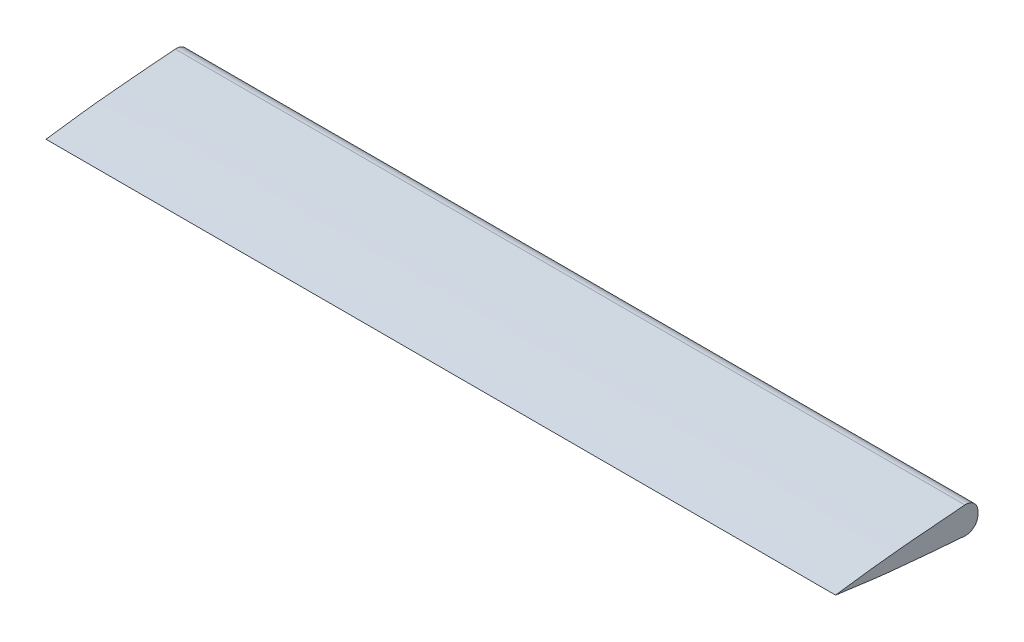
ISO-10303-21;
HEADER;
FILE_DESCRIPTION(('STEP AP214'),'2;1');
FILE_NAME('part.step','',(''),(''),'','','');
FILE_SCHEMA(('AUTOMOTIVE_DESIGN { 1 0 10303 214 1 1 1 1 }'));
ENDSEC;
DATA;
#1=APPLICATION_CONTEXT('core data for automotive mechanical design processes');
#2=APPLICATION_PROTOCOL_DEFINITION('international standard','automotive_design',2000,#1);
#3=PRODUCT_CONTEXT('',#1,'mechanical');
#4=PRODUCT('Part','Part','',(#3));
#5=PRODUCT_RELATED_PRODUCT_CATEGORY('part','',(#4));
#6=PRODUCT_DEFINITION_FORMATION('','',#4);
#7=PRODUCT_DEFINITION_CONTEXT('part definition',#1,'design');
#8=PRODUCT_DEFINITION('design','',#6,#7);
#9=PRODUCT_DEFINITION_SHAPE('','',#8);
#10=(LENGTH_UNIT() NAMED_UNIT(*) SI_UNIT(.MILLI.,.METRE.));
#11=(NAMED_UNIT(*) PLANE_ANGLE_UNIT() SI_UNIT($,.RADIAN.));
#12=(NAMED_UNIT(*) SI_UNIT($,.STERADIAN.) SOLID_ANGLE_UNIT());
#13=UNCERTAINTY_MEASURE_WITH_UNIT(LENGTH_MEASURE(1.E-05),#10,'distance_accuracy_value','');
#14=(GEOMETRIC_REPRESENTATION_CONTEXT(3) GLOBAL_UNCERTAINTY_ASSIGNED_CONTEXT((#13)) GLOBAL_UNIT_ASSIGNED_CONTEXT((#10,
#11,#12)) REPRESENTATION_CONTEXT('',''));
#15=CARTESIAN_POINT('',(0.,0.,0.));
#16=DIRECTION('',(0.,0.,1.));
#17=DIRECTION('',(1.,0.,0.));
#18=AXIS2_PLACEMENT_3D('',#15,#16,#17);
#19=CARTESIAN_POINT('',(95.,-1.92918916965094,35.0000000000882));
#20=CARTESIAN_POINT('',(95.,-2.17557439307267,33.160206008529));
#21=CARTESIAN_POINT('',(95.,-2.66632647643486,29.4805088024827));
#22=CARTESIAN_POINT('',(95.,-3.41585990116421,23.9619552997979));
#23=CARTESIAN_POINT('',(95.,-3.95970264975798,18.4191434620528));
#24=CARTESIAN_POINT('',(95.,-4.4647734457858,12.8737838001964));
#25=CARTESIAN_POINT('',(95.,-4.84793778183102,8.24885263101138));
#26=CARTESIAN_POINT('',(95.,-5.13594709462944,4.54766157493358));
#27=CARTESIAN_POINT('',(95.,-5.3172452247453,2.1063633274242));
#28=CARTESIAN_POINT('',(95.,-5.42564338367872,0.590331068243133));
#29=CARTESIAN_POINT('',(95.,-5.46717732764397,1.00253139123652E-10));
#30=B_SPLINE_CURVE_WITH_KNOTS('',3,(#19,#20,#21,#22,#23,#24,#25,#26,#27,#28,#29),.UNSPECIFIED.,
.F.,.F.,(4,1,1,1,1,1,1,1,4),(0.811923721341245,0.841688208261256,0.871452695181268,
0.901217182101278,0.93098166902129,0.9607461559413,0.975628399401306,0.990510642861312,1.),.UNSPECIFIED.);
#31=DIRECTION('',(-1.,0.,0.));
#32=VECTOR('',#31,1.);
#33=SURFACE_OF_LINEAR_EXTRUSION('',#30,#32);
#34=CARTESIAN_POINT('',(75.,-1.92918916965094,35.0000000000882));
#35=CARTESIAN_POINT('',(75.,-2.17557439307267,33.160206008529));
#36=CARTESIAN_POINT('',(75.,-2.66632647643486,29.4805088024827));
#37=CARTESIAN_POINT('',(75.,-3.41585990116421,23.9619552997979));
#38=CARTESIAN_POINT('',(75.,-3.95970264975798,18.4191434620528));
#39=CARTESIAN_POINT('',(75.,-4.4647734457858,12.8737838001964));
#40=CARTESIAN_POINT('',(75.,-4.84793778183102,8.24885263101138));
#41=CARTESIAN_POINT('',(75.,-5.13594709462944,4.54766157493358));
#42=CARTESIAN_POINT('',(75.,-5.3172452247453,2.1063633274242));
#43=CARTESIAN_POINT('',(75.,-5.42564338367872,0.590331068243133));
#44=CARTESIAN_POINT('',(75.,-5.46717732764397,1.00253139123652E-10));
#45=B_SPLINE_CURVE_WITH_KNOTS('',3,(#34,#35,#36,#37,#38,#39,#40,#41,#42,#43,#44),.UNSPECIFIED.,
.F.,.F.,(4,1,1,1,1,1,1,1,4),(0.811923721341245,0.841688208261256,0.871452695181268,
0.901217182101278,0.93098166902129,0.9607461559413,0.975628399401306,0.990510642861312,1.),.UNSPECIFIED.);
#46=CARTESIAN_POINT('',(75.,-5.23395472823332,3.22247788486881));
#47=VERTEX_POINT('',#46);
#48=CARTESIAN_POINT('',(75.,-4.53258784285491,12.));
#49=VERTEX_POINT('',#48);
#50=EDGE_CURVE('E272',#47,#49,#45,.F.);
#51=ORIENTED_EDGE('',*,*,#50,.F.);
#52=DIRECTION('',(-1.,0.,0.));
#53=VECTOR('',#52,1.);
#54=CARTESIAN_POINT('',(95.,-5.23395472823332,3.22247788486881));
#55=LINE('',#54,#53);
#56=CARTESIAN_POINT('',(97.,-5.23395472823345,3.22247788486705));
#57=VERTEX_POINT('',#56);
#58=EDGE_CURVE('E351',#57,#47,#55,.T.);
#59=ORIENTED_EDGE('',*,*,#58,.F.);
#60=CARTESIAN_POINT('',(97.,-1.92918916965094,35.0000000000882));
#61=CARTESIAN_POINT('',(97.,-1.97784978920074,34.6366433608864));
#62=CARTESIAN_POINT('',(97.,-2.02647161022136,34.273281531584));
#63=CARTESIAN_POINT('',(97.,-2.12368704921667,33.546552866673));
#64=CARTESIAN_POINT('',(97.,-2.17228066709682,33.1831860310516));
#65=CARTESIAN_POINT('',(97.,-2.26948887733085,32.4564543480221));
#66=CARTESIAN_POINT('',(97.,-2.31810346973077,32.0930895006201));
#67=CARTESIAN_POINT('',(97.,-2.41540465670598,31.3663690370475));
#68=CARTESIAN_POINT('',(97.,-2.4640912513607,31.0030134208875));
#69=CARTESIAN_POINT('',(97.,-2.56157560888904,30.2763508963883));
#70=CARTESIAN_POINT('',(97.,-2.61037336119507,29.9130439866326));
#71=CARTESIAN_POINT('',(97.,-2.70815582961272,29.1864554795267));
#72=CARTESIAN_POINT('',(97.,-2.75714054565528,28.8231738821672));
#73=CARTESIAN_POINT('',(97.,-2.85476309263819,28.0965646669991));
#74=CARTESIAN_POINT('',(97.,-2.90340092424832,27.7332370492807));
#75=CARTESIAN_POINT('',(97.,-2.99976120769806,27.0064595602992));
#76=CARTESIAN_POINT('',(97.,-3.04748365885674,26.6430096889454));
#77=CARTESIAN_POINT('',(97.,-3.12580258604219,26.0370215022744));
#78=CARTESIAN_POINT('',(97.,-3.1568084296504,25.7945361768171));
#79=CARTESIAN_POINT('',(97.,-3.21799548575084,25.3094614244014));
#80=CARTESIAN_POINT('',(97.,-3.24817669855135,25.0668719974821));
#81=CARTESIAN_POINT('',(97.,-3.30755373753616,24.5815748631894));
#82=CARTESIAN_POINT('',(97.,-3.33674957404386,24.3388671570822));
#83=CARTESIAN_POINT('',(97.,-3.3939641059896,23.8533130477647));
#84=CARTESIAN_POINT('',(97.,-3.42198280196338,23.6104666446175));
#85=CARTESIAN_POINT('',(97.,-3.47692412565455,23.1246515568309));
#86=CARTESIAN_POINT('',(97.,-3.50384675984782,22.8816828729224));
#87=CARTESIAN_POINT('',(97.,-3.55673460009936,22.3956412774917));
#88=CARTESIAN_POINT('',(97.,-3.58269980516509,22.1525683658617));
#89=CARTESIAN_POINT('',(97.,-3.65934733869446,21.4232082406151));
#90=CARTESIAN_POINT('',(97.,-3.70878045188032,20.9367897563355));
#91=CARTESIAN_POINT('',(97.,-3.80533182082476,19.9637159425367));
#92=CARTESIAN_POINT('',(97.,-3.85245003218248,19.4770606086554));
#93=CARTESIAN_POINT('',(97.,-3.92216728077433,18.7469838606732));
#94=CARTESIAN_POINT('',(97.,-3.94524647381487,18.5036080105316));
#95=CARTESIAN_POINT('',(97.,-3.99118971519483,18.0168360210816));
#96=CARTESIAN_POINT('',(97.,-4.01405376355185,17.773439881775));
#97=CARTESIAN_POINT('',(97.,-4.1110323123454,16.7357832870622));
#98=CARTESIAN_POINT('',(97.,-4.18403320669951,15.9414183645363));
#99=CARTESIAN_POINT('',(97.,-4.32741147591866,14.3524639158053));
#100=CARTESIAN_POINT('',(97.,-4.3977888906516,13.5578743931986));
#101=CARTESIAN_POINT('',(97.,-4.53575580560456,11.9684586916675));
#102=CARTESIAN_POINT('',(97.,-4.60334532454955,11.1736325143688));
#103=CARTESIAN_POINT('',(97.,-4.73595068599845,9.58386408911397));
#104=CARTESIAN_POINT('',(97.,-4.80096684329836,8.78892186736883));
#105=CARTESIAN_POINT('',(97.,-4.92868980525073,7.1988432813935));
#106=CARTESIAN_POINT('',(97.,-4.99139658477352,6.40370691514542));
#107=CARTESIAN_POINT('',(97.,-5.11445447595214,4.81323619262917));
#108=CARTESIAN_POINT('',(97.,-5.17480554120495,4.01790183277115));
#109=CARTESIAN_POINT('',(97.,-5.23395472823345,3.22247788486705));
#110=B_SPLINE_CURVE_WITH_KNOTS('',3,(#60,#61,#62,#63,#64,#65,#66,#67,#68,#69,#70,#71,#72,#73,
#74,#75,#76,#77,#78,#79,#80,#81,#82,#83,#84,#85,#86,#87,#88,#89,#90,#91,#92,#93,#94,#95,#96,#97,
#98,#99,#100,#101,#102,#103,#104,#105,#106,#107,#108,#109),.UNSPECIFIED.,.F.,.F.,(4,2,2,2,2,2,2,
2,2,2,2,2,2,2,2,2,2,2,2,2,2,2,2,2,4),(0.,1.09980139469961,2.19960645543168,3.29941394316692,
4.39922264509033,5.49893082378594,6.59863859639634,7.698344245053,8.79805071172301,
9.53142838044405,10.2648057750098,10.998175483896,11.7315448590075,12.4649099005178,
13.1982757022749,14.6650378540183,16.1318281279384,16.8652311563979,17.5986341248993,
19.991766251133,22.3848619951152,24.7779416631786,27.1707276783879,29.563539723203,
31.9563988780375),.UNSPECIFIED.);
#111=CARTESIAN_POINT('',(97.,-1.92918916965094,35.0000000000882));
#112=VERTEX_POINT('',#111);
#113=EDGE_CURVE('E170',#112,#57,#110,.T.);
#114=ORIENTED_EDGE('',*,*,#113,.F.);
#115=DIRECTION('',(-1.,0.,0.));
#116=VECTOR('',#115,1.);
#117=CARTESIAN_POINT('',(95.,-1.92918916965094,35.0000000000882));
#118=LINE('',#117,#116);
#119=CARTESIAN_POINT('',(-97.,-1.92918916965094,35.0000000000882));
#120=VERTEX_POINT('',#119);
#121=EDGE_CURVE('E354',#112,#120,#118,.T.);
#122=ORIENTED_EDGE('',*,*,#121,.T.);
#123=CARTESIAN_POINT('',(-97.,-5.23395472823345,3.22247788486705));
#124=CARTESIAN_POINT('',(-97.,-5.17959788113648,3.95360466691651));
#125=CARTESIAN_POINT('',(-97.,-5.12421072380217,4.68465461989659));
#126=CARTESIAN_POINT('',(-97.,-5.01143847883272,6.14660752473185));
#127=CARTESIAN_POINT('',(-97.,-4.95405337194786,6.87751047510242));
#128=CARTESIAN_POINT('',(-97.,-4.83734309943591,8.3392354421591));
#129=CARTESIAN_POINT('',(-97.,-4.77801773926795,9.070057443312));
#130=CARTESIAN_POINT('',(-97.,-4.65724890204201,10.5315214491633));
#131=CARTESIAN_POINT('',(-97.,-4.59580544021058,11.2621634551176));
#132=CARTESIAN_POINT('',(-97.,-4.49148487350541,12.4797284248955));
#133=CARTESIAN_POINT('',(-97.,-4.44924626133113,12.9667061571132));
#134=CARTESIAN_POINT('',(-97.,-4.36372871484579,13.9405726039608));
#135=CARTESIAN_POINT('',(-97.,-4.32044977562507,14.4274613181597));
#136=CARTESIAN_POINT('',(-97.,-4.23290306692659,15.4011574918594));
#137=CARTESIAN_POINT('',(-97.,-4.1886352819466,15.8879649499656));
#138=CARTESIAN_POINT('',(-97.,-4.09914794877604,16.8614631098632));
#139=CARTESIAN_POINT('',(-97.,-4.05392845747156,17.3481538168843));
#140=CARTESIAN_POINT('',(-97.,-3.98542606667977,18.0781240308911));
#141=CARTESIAN_POINT('',(-97.,-3.96247986766407,18.3214351701409));
#142=CARTESIAN_POINT('',(-97.,-3.91634783629059,18.8080346603303));
#143=CARTESIAN_POINT('',(-97.,-3.89316200395223,19.0513230112719));
#144=CARTESIAN_POINT('',(-97.,-3.8230390963603,19.7811160415341));
#145=CARTESIAN_POINT('',(-97.,-3.77553492385513,20.26756684431));
#146=CARTESIAN_POINT('',(-97.,-3.69692905674574,21.0515101659648));
#147=CARTESIAN_POINT('',(-97.,-3.66661518141091,21.3490815266299));
#148=CARTESIAN_POINT('',(-97.,-3.60480659528878,21.9441019409285));
#149=CARTESIAN_POINT('',(-97.,-3.57331188430276,22.2415509945414));
#150=CARTESIAN_POINT('',(-97.,-3.5089215993608,22.8362969136044));
#151=CARTESIAN_POINT('',(-97.,-3.4760260298558,23.1335937795349));
#152=CARTESIAN_POINT('',(-97.,-3.40855448857751,23.7279965901783));
#153=CARTESIAN_POINT('',(-97.,-3.37397852001132,24.0251025352545));
#154=CARTESIAN_POINT('',(-97.,-3.30312398859748,24.6191261255019));
#155=CARTESIAN_POINT('',(-97.,-3.26684533997212,24.916043760421));
#156=CARTESIAN_POINT('',(-97.,-3.19295061838863,25.509712733074));
#157=CARTESIAN_POINT('',(-97.,-3.1553345421647,25.8064640704));
#158=CARTESIAN_POINT('',(-97.,-3.04091420356514,26.6965576242049));
#159=CARTESIAN_POINT('',(-97.,-2.96254288039535,27.2896977905826));
#160=CARTESIAN_POINT('',(-97.,-2.84367135378822,28.1793206271627));
#161=CARTESIAN_POINT('',(-97.,-2.80382230292623,28.4758917929431));
#162=CARTESIAN_POINT('',(-97.,-2.72400928001107,29.0690188459661));
#163=CARTESIAN_POINT('',(-97.,-2.68404530795805,29.3655747332086));
#164=CARTESIAN_POINT('',(-97.,-2.56434314170112,30.2552505966117));
#165=CARTESIAN_POINT('',(-97.,-2.48479240007927,30.8483957408641));
#166=CARTESIAN_POINT('',(-97.,-2.32590590727896,32.0346622266487));
#167=CARTESIAN_POINT('',(-97.,-2.24657013798156,32.6277835657556));
#168=CARTESIAN_POINT('',(-97.,-2.08791801013651,33.813940892333));
#169=CARTESIAN_POINT('',(-97.,-2.00860165044481,34.4069768796505));
#170=CARTESIAN_POINT('',(-97.,-1.92918916965094,35.0000000000882));
#171=B_SPLINE_CURVE_WITH_KNOTS('',3,(#123,#124,#125,#126,#127,#128,#129,#130,#131,#132,#133,
#134,#135,#136,#137,#138,#139,#140,#141,#142,#143,#144,#145,#146,#147,#148,#149,#150,#151,#152,
#153,#154,#155,#156,#157,#158,#159,#160,#161,#162,#163,#164,#165,#166,#167,#168,#169,#170),
.UNSPECIFIED.,.F.,.F.,(4,2,2,2,2,2,2,2,2,2,2,2,2,2,2,2,2,2,2,2,2,2,2,4),(0.,2.19943278650305,
4.39888676983374,6.59856196317479,8.79822134685075,10.2646386376926,11.7310628504289,
13.1975100685825,14.6638698806888,15.3970420053715,16.1302140706628,17.5965035286424,
18.493835947988,19.3911685183452,20.2884982378313,21.1858262448014,22.083199506032,
22.980574958658,24.7754515522521,25.6731610797107,26.5708706060505,28.3662382950348,
30.1614496362272,31.9563994613003),.UNSPECIFIED.);
#172=CARTESIAN_POINT('',(-97.,-5.23395472823345,3.22247788486705));
#173=VERTEX_POINT('',#172);
#174=EDGE_CURVE('E177',#173,#120,#171,.T.);
#175=ORIENTED_EDGE('',*,*,#174,.F.);
#176=CARTESIAN_POINT('',(-75.,-5.23395472823332,3.22247788486881));
#177=VERTEX_POINT('',#176);
#178=EDGE_CURVE('E157',#177,#173,#55,.T.);
#179=ORIENTED_EDGE('',*,*,#178,.F.);
#180=CARTESIAN_POINT('',(-75.,-1.92918916965094,35.0000000000882));
#181=CARTESIAN_POINT('',(-75.,-2.17557439307267,33.160206008529));
#182=CARTESIAN_POINT('',(-75.,-2.66632647643486,29.4805088024827));
#183=CARTESIAN_POINT('',(-75.,-3.41585990116421,23.9619552997979));
#184=CARTESIAN_POINT('',(-75.,-3.95970264975798,18.4191434620528));
#185=CARTESIAN_POINT('',(-75.,-4.4647734457858,12.8737838001964));
#186=CARTESIAN_POINT('',(-75.,-4.84793778183102,8.24885263101138));
#187=CARTESIAN_POINT('',(-75.,-5.13594709462944,4.54766157493358));
#188=CARTESIAN_POINT('',(-75.,-5.3172452247453,2.1063633274242));
#189=CARTESIAN_POINT('',(-75.,-5.42564338367872,0.590331068243133));
#190=CARTESIAN_POINT('',(-75.,-5.46717732764397,1.00253139123652E-10));
#191=B_SPLINE_CURVE_WITH_KNOTS('',3,(#180,#181,#182,#183,#184,#185,#186,#187,#188,#189,#190),
.UNSPECIFIED.,.F.,.F.,(4,1,1,1,1,1,1,1,4),(0.811923721341245,0.841688208261256,
0.871452695181268,0.901217182101278,0.93098166902129,0.9607461559413,0.975628399401306,
0.990510642861312,1.),.UNSPECIFIED.);
#192=CARTESIAN_POINT('',(-75.,-4.53258771436027,12.0000015045158));
#193=VERTEX_POINT('',#192);
#194=EDGE_CURVE('E246',#193,#177,#191,.T.);
#195=ORIENTED_EDGE('',*,*,#194,.F.);
#196=DIRECTION('',(-1.,0.,0.));
#197=VECTOR('',#196,1.);
#198=CARTESIAN_POINT('',(95.,-4.53258771393965,12.0000015045159));
#199=LINE('',#198,#197);
#200=CARTESIAN_POINT('',(-63.,-4.53258771393965,12.0000015045158));
#201=VERTEX_POINT('',#200);
#202=EDGE_CURVE('E46',#201,#193,#199,.T.);
#203=ORIENTED_EDGE('',*,*,#202,.F.);
#204=CARTESIAN_POINT('',(-63.,-1.92918916965094,35.0000000000882));
#205=CARTESIAN_POINT('',(-63.,-2.17557439307267,33.160206008529));
#206=CARTESIAN_POINT('',(-63.,-2.66632647643486,29.4805088024827));
#207=CARTESIAN_POINT('',(-63.,-3.41585990116421,23.9619552997979));
#208=CARTESIAN_POINT('',(-63.,-3.95970264975798,18.4191434620528));
#209=CARTESIAN_POINT('',(-63.,-4.4647734457858,12.8737838001964));
#210=CARTESIAN_POINT('',(-63.,-4.84793778183102,8.24885263101138));
#211=CARTESIAN_POINT('',(-63.,-5.13594709462944,4.54766157493358));
#212=CARTESIAN_POINT('',(-63.,-5.3172452247453,2.1063633274242));
#213=CARTESIAN_POINT('',(-63.,-5.42564338367872,0.590331068243133));
#214=CARTESIAN_POINT('',(-63.,-5.46717732764397,1.00253139123652E-10));
#215=B_SPLINE_CURVE_WITH_KNOTS('',3,(#204,#205,#206,#207,#208,#209,#210,#211,#212,#213,#214),
.UNSPECIFIED.,.F.,.F.,(4,1,1,1,1,1,1,1,4),(0.811923721341245,0.841688208261256,
0.871452695181268,0.901217182101278,0.93098166902129,0.9607461559413,0.975628399401306,
0.990510642861312,1.),.UNSPECIFIED.);
#216=CARTESIAN_POINT('',(-63.,-5.23395472823332,3.22247788486881));
#217=VERTEX_POINT('',#216);
#218=EDGE_CURVE('E255',#217,#201,#215,.F.);
#219=ORIENTED_EDGE('',*,*,#218,.F.);
#220=CARTESIAN_POINT('',(63.,-5.23395472823332,3.22247788486881));
#221=VERTEX_POINT('',#220);
#222=EDGE_CURVE('E346',#221,#217,#55,.T.);
#223=ORIENTED_EDGE('',*,*,#222,.F.);
#224=CARTESIAN_POINT('',(63.,-1.92918916965094,35.0000000000882));
#225=CARTESIAN_POINT('',(63.,-2.17557439307267,33.160206008529));
#226=CARTESIAN_POINT('',(63.,-2.66632647643486,29.4805088024827));
#227=CARTESIAN_POINT('',(63.,-3.41585990116421,23.9619552997979));
#228=CARTESIAN_POINT('',(63.,-3.95970264975798,18.4191434620528));
#229=CARTESIAN_POINT('',(63.,-4.4647734457858,12.8737838001964));
#230=CARTESIAN_POINT('',(63.,-4.84793778183102,8.24885263101138));
#231=CARTESIAN_POINT('',(63.,-5.13594709462944,4.54766157493358));
#232=CARTESIAN_POINT('',(63.,-5.3172452247453,2.1063633274242));
#233=CARTESIAN_POINT('',(63.,-5.42564338367872,0.590331068243133));
#234=CARTESIAN_POINT('',(63.,-5.46717732764397,1.00253139123652E-10));
#235=B_SPLINE_CURVE_WITH_KNOTS('',3,(#224,#225,#226,#227,#228,#229,#230,#231,#232,#233,#234),
.UNSPECIFIED.,.F.,.F.,(4,1,1,1,1,1,1,1,4),(0.811923721341245,0.841688208261256,
0.871452695181268,0.901217182101278,0.93098166902129,0.9607461559413,0.975628399401306,
0.990510642861312,1.),.UNSPECIFIED.);
#236=CARTESIAN_POINT('',(63.,-4.53258784327553,12.));
#237=VERTEX_POINT('',#236);
#238=EDGE_CURVE('E264',#237,#221,#235,.T.);
#239=ORIENTED_EDGE('',*,*,#238,.F.);
#240=DIRECTION('',(-1.,0.,0.));
#241=VECTOR('',#240,1.);
#242=CARTESIAN_POINT('',(95.,-4.53258784285491,12.));
#243=LINE('',#242,#241);
#244=EDGE_CURVE('E11',#49,#237,#243,.T.);
#245=ORIENTED_EDGE('',*,*,#244,.F.);
#246=EDGE_LOOP('',(#51,#59,#114,#122,#175,#179,#195,#203,#219,#223,#239,#245));
#247=FACE_BOUND('',#246,.T.);
#248=ADVANCED_FACE('F36',(#247),#33,.F.);
#249=CARTESIAN_POINT('',(95.,-2.24221550317638,3.));
#250=DIRECTION('',(-1.,0.,0.));
#251=DIRECTION('',(0.,0.,1.));
#252=AXIS2_PLACEMENT_3D('',#249,#250,#251);
#253=CYLINDRICAL_SURFACE('',#252,3.);
#254=CARTESIAN_POINT('',(75.,-2.24221550317638,3.));
#255=DIRECTION('',(-1.,0.,0.));
#256=DIRECTION('',(0.,0.,1.));
#257=AXIS2_PLACEMENT_3D('',#254,#255,#256);
#258=CIRCLE('',#257,3.);
#259=CARTESIAN_POINT('',(75.,-2.24221550317638,0.));
#260=VERTEX_POINT('',#259);
#261=EDGE_CURVE('E151',#260,#47,#258,.T.);
#262=ORIENTED_EDGE('',*,*,#261,.F.);
#263=DIRECTION('',(-1.,0.,0.));
#264=VECTOR('',#263,1.);
#265=CARTESIAN_POINT('',(95.,-2.24221550317638,0.));
#266=LINE('',#265,#264);
#267=CARTESIAN_POINT('',(97.,-2.24221550317638,0.));
#268=VERTEX_POINT('',#267);
#269=EDGE_CURVE('E146',#268,#260,#266,.T.);
#270=ORIENTED_EDGE('',*,*,#269,.F.);
#271=CARTESIAN_POINT('',(97.,-2.24221550317638,3.));
#272=DIRECTION('',(1.,0.,0.));
#273=DIRECTION('',(0.,0.,-1.));
#274=AXIS2_PLACEMENT_3D('',#271,#272,#273);
#275=CIRCLE('',#274,3.);
#276=EDGE_CURVE('E150',#57,#268,#275,.T.);
#277=ORIENTED_EDGE('',*,*,#276,.F.);
#278=ORIENTED_EDGE('',*,*,#58,.T.);
#279=EDGE_LOOP('',(#262,#270,#277,#278));
#280=FACE_BOUND('',#279,.T.);
#281=ADVANCED_FACE('F148',(#280),#253,.T.);
#282=CARTESIAN_POINT('',(63.,-2.24221550317638,3.));
#283=DIRECTION('',(1.,0.,0.));
#284=DIRECTION('',(0.,0.,-1.));
#285=AXIS2_PLACEMENT_3D('',#282,#283,#284);
#286=CIRCLE('',#285,3.);
#287=CARTESIAN_POINT('',(63.,-2.24221550317638,0.));
#288=VERTEX_POINT('',#287);
#289=EDGE_CURVE('E259',#221,#288,#286,.T.);
#290=ORIENTED_EDGE('',*,*,#289,.F.);
#291=ORIENTED_EDGE('',*,*,#222,.T.);
#292=CARTESIAN_POINT('',(-63.,-2.24221550317638,3.));
#293=DIRECTION('',(-1.,0.,0.));
#294=DIRECTION('',(0.,0.,1.));
#295=AXIS2_PLACEMENT_3D('',#292,#293,#294);
#296=CIRCLE('',#295,3.);
#297=CARTESIAN_POINT('',(-63.,-2.24221550317638,1.50451584497282E-06));
#298=VERTEX_POINT('',#297);
#299=EDGE_CURVE('E250',#298,#217,#296,.T.);
#300=ORIENTED_EDGE('',*,*,#299,.F.);
#301=EDGE_CURVE('E158',#288,#298,#266,.T.);
#302=ORIENTED_EDGE('',*,*,#301,.F.);
#303=EDGE_LOOP('',(#290,#291,#300,#302));
#304=FACE_BOUND('',#303,.T.);
#305=ADVANCED_FACE('F301',(#304),#253,.T.);
#306=CARTESIAN_POINT('',(-75.,-2.24221550317638,3.));
#307=DIRECTION('',(1.,0.,0.));
#308=DIRECTION('',(0.,0.,-1.));
#309=AXIS2_PLACEMENT_3D('',#306,#307,#308);
#310=CIRCLE('',#309,3.);
#311=CARTESIAN_POINT('',(-75.,-2.24221550317638,1.50451583005451E-06));
#312=VERTEX_POINT('',#311);
#313=EDGE_CURVE('E232',#177,#312,#310,.T.);
#314=ORIENTED_EDGE('',*,*,#313,.F.);
#315=ORIENTED_EDGE('',*,*,#178,.T.);
#316=CARTESIAN_POINT('',(-97.,-2.24221550317638,3.));
#317=DIRECTION('',(-1.,0.,0.));
#318=DIRECTION('',(0.,0.,1.));
#319=AXIS2_PLACEMENT_3D('',#316,#317,#318);
#320=CIRCLE('',#319,3.);
#321=CARTESIAN_POINT('',(-97.,-2.24221550317638,0.));
#322=VERTEX_POINT('',#321);
#323=EDGE_CURVE('E237',#322,#173,#320,.T.);
#324=ORIENTED_EDGE('',*,*,#323,.F.);
#325=EDGE_CURVE('E160',#312,#322,#266,.T.);
#326=ORIENTED_EDGE('',*,*,#325,.F.);
#327=EDGE_LOOP('',(#314,#315,#324,#326));
#328=FACE_BOUND('',#327,.T.);
#329=ADVANCED_FACE('F302',(#328),#253,.T.);
#330=CARTESIAN_POINT('',(95.,-2.24221550317638,0.));
#331=DIRECTION('',(0.,0.,1.));
#332=DIRECTION('',(1.,0.,0.));
#333=AXIS2_PLACEMENT_3D('',#330,#331,#332);
#334=PLANE('',#333);
#335=DIRECTION('',(0.,-1.,0.));
#336=VECTOR('',#335,1.);
#337=CARTESIAN_POINT('',(75.,-2.24221550317638,0.));
#338=LINE('',#337,#336);
#339=CARTESIAN_POINT('',(75.,-1.92918916965094,0.));
#340=VERTEX_POINT('',#339);
#341=EDGE_CURVE('E365',#340,#260,#338,.T.);
#342=ORIENTED_EDGE('',*,*,#341,.F.);
#343=DIRECTION('',(1.,0.,0.));
#344=VECTOR('',#343,1.);
#345=CARTESIAN_POINT('',(75.,-1.92918916965094,0.));
#346=LINE('',#345,#344);
#347=CARTESIAN_POINT('',(63.,-1.92918916965094,0.));
#348=VERTEX_POINT('',#347);
#349=EDGE_CURVE('E226',#348,#340,#346,.T.);
#350=ORIENTED_EDGE('',*,*,#349,.F.);
#351=DIRECTION('',(0.,1.,0.));
#352=VECTOR('',#351,1.);
#353=CARTESIAN_POINT('',(63.,-2.24221550317638,0.));
#354=LINE('',#353,#352);
#355=EDGE_CURVE('E363',#288,#348,#354,.T.);
#356=ORIENTED_EDGE('',*,*,#355,.F.);
#357=ORIENTED_EDGE('',*,*,#301,.T.);
#358=DIRECTION('',(0.,-1.,0.));
#359=VECTOR('',#358,1.);
#360=CARTESIAN_POINT('',(-63.,-2.24221550317638,0.));
#361=LINE('',#360,#359);
#362=CARTESIAN_POINT('',(-63.,-1.92918916965094,1.50451584501023E-06));
#363=VERTEX_POINT('',#362);
#364=EDGE_CURVE('E360',#363,#298,#361,.T.);
#365=ORIENTED_EDGE('',*,*,#364,.F.);
#366=DIRECTION('',(1.,0.,0.));
#367=VECTOR('',#366,1.);
#368=CARTESIAN_POINT('',(-63.,-1.92918916965094,1.50451584501023E-06));
#369=LINE('',#368,#367);
#370=CARTESIAN_POINT('',(-75.,-1.92918916965094,0.));
#371=VERTEX_POINT('',#370);
#372=EDGE_CURVE('E240',#371,#363,#369,.T.);
#373=ORIENTED_EDGE('',*,*,#372,.F.);
#374=DIRECTION('',(0.,1.,0.));
#375=VECTOR('',#374,1.);
#376=CARTESIAN_POINT('',(-75.,-2.24221550317638,0.));
#377=LINE('',#376,#375);
#378=EDGE_CURVE('E358',#312,#371,#377,.T.);
#379=ORIENTED_EDGE('',*,*,#378,.F.);
#380=ORIENTED_EDGE('',*,*,#325,.T.);
#381=DIRECTION('',(0.,-1.,0.));
#382=VECTOR('',#381,1.);
#383=CARTESIAN_POINT('',(-97.,-1.62243157022335,0.));
#384=LINE('',#383,#382);
#385=CARTESIAN_POINT('',(-97.,-1.62243157022335,0.));
#386=VERTEX_POINT('',#385);
#387=EDGE_CURVE('E380',#386,#322,#384,.T.);
#388=ORIENTED_EDGE('',*,*,#387,.F.);
#389=DIRECTION('',(-1.,0.,0.));
#390=VECTOR('',#389,1.);
#391=CARTESIAN_POINT('',(95.,-1.62243157022335,0.));
#392=LINE('',#391,#390);
#393=CARTESIAN_POINT('',(97.,-1.62243157022335,0.));
#394=VERTEX_POINT('',#393);
#395=EDGE_CURVE('E174',#394,#386,#392,.T.);
#396=ORIENTED_EDGE('',*,*,#395,.F.);
#397=DIRECTION('',(0.,1.,0.));
#398=VECTOR('',#397,1.);
#399=CARTESIAN_POINT('',(97.,-2.24221550317638,0.));
#400=LINE('',#399,#398);
#401=EDGE_CURVE('E167',#268,#394,#400,.T.);
#402=ORIENTED_EDGE('',*,*,#401,.F.);
#403=ORIENTED_EDGE('',*,*,#269,.T.);
#404=EDGE_LOOP('',(#342,#350,#356,#357,#365,#373,#379,#380,#388,#396,#402,#403));
#405=FACE_BOUND('',#404,.T.);
#406=ADVANCED_FACE('F172',(#405),#334,.F.);
#407=CARTESIAN_POINT('',(95.,1.60281126342663,8.85957973650875E-11));
#408=CARTESIAN_POINT('',(95.,1.57394539771646,0.41026300694158));
#409=CARTESIAN_POINT('',(95.,1.47884884067585,1.74626983989812));
#410=CARTESIAN_POINT('',(95.,1.24367868072227,4.93322139762531));
#411=CARTESIAN_POINT('',(95.,0.879068879291141,9.55943402661152));
#412=CARTESIAN_POINT('',(95.,0.402320573106345,15.1077148574105));
#413=CARTESIAN_POINT('',(95.,-0.115314326066247,20.6522555616344));
#414=CARTESIAN_POINT('',(95.,-0.519945386297416,24.3429073706004));
#415=CARTESIAN_POINT('',(95.,-0.852957365534264,26.9188208394414));
#416=CARTESIAN_POINT('',(95.,-1.04863587537364,28.3881261413769));
#417=CARTESIAN_POINT('',(95.,-1.34215364013276,30.5920840942815));
#418=CARTESIAN_POINT('',(95.,-1.63567140489183,32.7960420471839));
#419=CARTESIAN_POINT('',(95.,-1.83134991473125,34.2653473491202));
#420=CARTESIAN_POINT('',(95.,-1.92918916965094,35.0000000000882));
#421=B_SPLINE_CURVE_WITH_KNOTS('',3,(#407,#408,#409,#410,#411,#412,#413,#414,#415,#416,#417,
#418,#419,#420),.UNSPECIFIED.,.F.,.F.,(4,1,1,1,1,1,2,1,1,1,4),(0.,0.00659483708141254,
0.0214770805414181,0.0512415674614291,0.0810060543814401,0.110770541301451,0.140535028221462,
0.152419132861374,0.164303237501286,0.176187342141197,0.188071446781109),.UNSPECIFIED.);
#422=DIRECTION('',(-1.,0.,0.));
#423=VECTOR('',#422,1.);
#424=SURFACE_OF_LINEAR_EXTRUSION('',#421,#423);
#425=DIRECTION('',(-1.,0.,0.));
#426=VECTOR('',#425,1.);
#427=CARTESIAN_POINT('',(95.,1.36927569522841,3.22290724044576));
#428=LINE('',#427,#426);
#429=CARTESIAN_POINT('',(97.,1.36927569522844,3.22290724044543));
#430=VERTEX_POINT('',#429);
#431=CARTESIAN_POINT('',(-97.,1.36927569522844,3.22290724044543));
#432=VERTEX_POINT('',#431);
#433=EDGE_CURVE('E275',#430,#432,#428,.T.);
#434=ORIENTED_EDGE('',*,*,#433,.T.);
#435=CARTESIAN_POINT('',(-97.,-1.92918916965094,35.0000000000882));
#436=CARTESIAN_POINT('',(-97.,-1.88079792876517,34.6366413448243));
#437=CARTESIAN_POINT('',(-97.,-1.83240671456315,34.2732826860061));
#438=CARTESIAN_POINT('',(-97.,-1.7356237622953,33.5465614347935));
#439=CARTESIAN_POINT('',(-97.,-1.68723202422947,33.1831988423991));
#440=CARTESIAN_POINT('',(-97.,-1.59044814613663,32.4564710472203));
#441=CARTESIAN_POINT('',(-97.,-1.54205600610925,32.0931058444358));
#442=CARTESIAN_POINT('',(-97.,-1.445271766212,31.3663741090089));
#443=CARTESIAN_POINT('',(-97.,-1.39687966634289,31.0030075763663));
#444=CARTESIAN_POINT('',(-97.,-1.30009839490373,30.2763026166186));
#445=CARTESIAN_POINT('',(-97.,-1.25170922339534,29.9129641895052));
#446=CARTESIAN_POINT('',(-97.,-1.15493401136465,29.1862880082859));
#447=CARTESIAN_POINT('',(-97.,-1.10654797083352,28.8229502541811));
#448=CARTESIAN_POINT('',(-97.,-1.03396069297989,28.2779458456688));
#449=CARTESIAN_POINT('',(-97.,-1.00976363801749,28.0962786341561));
#450=CARTESIAN_POINT('',(-97.,-0.961440603041112,27.7329347188075));
#451=CARTESIAN_POINT('',(-97.,-0.937314623037823,27.5512580149702));
#452=CARTESIAN_POINT('',(-97.,-0.889225399616156,27.1878844984796));
#453=CARTESIAN_POINT('',(-97.,-0.86526215492023,27.0061876859957));
#454=CARTESIAN_POINT('',(-97.,-0.817569253516111,26.6427633576969));
#455=CARTESIAN_POINT('',(-97.,-0.79383959683469,26.4610358418785));
#456=CARTESIAN_POINT('',(-97.,-0.754592722421596,26.1580778546565));
#457=CARTESIAN_POINT('',(-97.,-0.738973030157824,26.0368607039626));
#458=CARTESIAN_POINT('',(-97.,-0.708064248720753,25.7943842823271));
#459=CARTESIAN_POINT('',(-97.,-0.692775159408509,25.6731250114033));
#460=CARTESIAN_POINT('',(-97.,-0.647332570571302,25.3092943864935));
#461=CARTESIAN_POINT('',(-97.,-0.617603711384828,25.06666992139));
#462=CARTESIAN_POINT('',(-97.,-0.559212157853746,24.5812947743446));
#463=CARTESIAN_POINT('',(-97.,-0.530549455483218,24.3385440933668));
#464=CARTESIAN_POINT('',(-97.,-0.474187398677327,23.8529307433053));
#465=CARTESIAN_POINT('',(-97.,-0.446488045639576,23.6100680740597));
#466=CARTESIAN_POINT('',(-97.,-0.364697148447402,22.8813331251535));
#467=CARTESIAN_POINT('',(-97.,-0.311912772759362,22.3953139590925));
#468=CARTESIAN_POINT('',(-97.,-0.20905291078176,21.4229807842095));
#469=CARTESIAN_POINT('',(-97.,-0.158977481769102,20.9366667693731));
#470=CARTESIAN_POINT('',(-97.,-0.0608251190211099,19.9638340144447));
#471=CARTESIAN_POINT('',(-97.,-0.0127481999033791,19.4773152728817));
#472=CARTESIAN_POINT('',(-97.,0.0816702509790136,18.5041072283164));
#473=CARTESIAN_POINT('',(-97.,0.128011773885307,18.0174179244563));
#474=CARTESIAN_POINT('',(-97.,0.248078611684043,16.7364441833294));
#475=CARTESIAN_POINT('',(-97.,0.320611398625833,15.9420482009703));
#476=CARTESIAN_POINT('',(-97.,0.463146708726868,14.3530340720332));
#477=CARTESIAN_POINT('',(-97.,0.533149243323773,13.5584159264759));
#478=CARTESIAN_POINT('',(-97.,0.670684074728854,11.9689667726085));
#479=CARTESIAN_POINT('',(-97.,0.738216375033,11.1741357646013));
#480=CARTESIAN_POINT('',(-97.,0.870843405958511,9.58434569582098));
#481=CARTESIAN_POINT('',(-97.,0.935938364922157,8.78938665408599));
#482=CARTESIAN_POINT('',(-97.,1.06375351324735,7.19927758982945));
#483=CARTESIAN_POINT('',(-97.,1.12647370214104,6.40412756727031));
#484=CARTESIAN_POINT('',(-97.,1.24959752867515,4.81364875795132));
#485=CARTESIAN_POINT('',(-97.,1.31000116804088,4.01831997132505));
#486=CARTESIAN_POINT('',(-97.,1.36927569522844,3.22290724044543));
#487=B_SPLINE_CURVE_WITH_KNOTS('',3,(#435,#436,#437,#438,#439,#440,#441,#442,#443,#444,#445,
#446,#447,#448,#449,#450,#451,#452,#453,#454,#455,#456,#457,#458,#459,#460,#461,#462,#463,#464,
#465,#466,#467,#468,#469,#470,#471,#472,#473,#474,#475,#476,#477,#478,#479,#480,#481,#482,#483,
#484,#485,#486),.UNSPECIFIED.,.F.,.F.,(4,2,2,2,2,2,2,2,2,2,2,2,2,2,2,2,2,2,2,2,2,2,2,2,2,4),(0.,
1.09970042327431,2.19941275146733,3.29913300148847,4.39885719024717,5.4984966406726,
6.59813284953205,7.14794759928045,7.69776243168407,8.24757294278575,8.7973835169026,
9.16404130725992,9.53069894351714,10.2640133115977,10.9973221582438,11.7306320687183,
13.1972520551383,14.6639030390837,16.1305647485953,17.5972339436937,19.9903284791477,
22.3834121955908,24.7764925251191,27.1693480951264,29.5622041365475,31.9550583957896),.UNSPECIFIED.);
#488=EDGE_CURVE('E211',#120,#432,#487,.T.);
#489=ORIENTED_EDGE('',*,*,#488,.F.);
#490=ORIENTED_EDGE('',*,*,#121,.F.);
#491=CARTESIAN_POINT('',(97.,1.36927569522844,3.22290724044543));
#492=CARTESIAN_POINT('',(97.,1.31479660798163,3.95397304183044));
#493=CARTESIAN_POINT('',(97.,1.25936339044736,4.68496787050244));
#494=CARTESIAN_POINT('',(97.,1.14654366613871,6.14681040354406));
#495=CARTESIAN_POINT('',(97.,1.08915714968594,6.87765810716664));
#496=CARTESIAN_POINT('',(97.,0.972380842224757,8.3392627512277));
#497=CARTESIAN_POINT('',(97.,0.912990863159998,9.07001967664737));
#498=CARTESIAN_POINT('',(97.,0.792168198984963,10.5313615019438));
#499=CARTESIAN_POINT('',(97.,0.730735522605712,11.2619464025423));
#500=CARTESIAN_POINT('',(97.,0.605791195521399,12.7229329975011));
#501=CARTESIAN_POINT('',(97.,0.54227956048731,13.4533346932005));
#502=CARTESIAN_POINT('',(97.,0.445433806394916,14.5488017339563));
#503=CARTESIAN_POINT('',(97.,0.412888643195899,14.9139369650192));
#504=CARTESIAN_POINT('',(97.,0.347254512874219,15.6441585143705));
#505=CARTESIAN_POINT('',(97.,0.314165545762922,16.0092448326599));
#506=CARTESIAN_POINT('',(97.,0.21388557498942,17.1043734633563));
#507=CARTESIAN_POINT('',(97.,0.145678171221904,17.8343233747256));
#508=CARTESIAN_POINT('',(97.,0.00558074291815669,19.2938500119669));
#509=CARTESIAN_POINT('',(97.,-0.0663091767854855,20.0234267478658));
#510=CARTESIAN_POINT('',(97.,-0.201151227871686,21.3479170783134));
#511=CARTESIAN_POINT('',(97.,-0.263314304645505,21.942910413215));
#512=CARTESIAN_POINT('',(97.,-0.359989505992433,22.835029766686));
#513=CARTESIAN_POINT('',(97.,-0.392786378273051,23.1323414609616));
#514=CARTESIAN_POINT('',(97.,-0.45969422840898,23.7268169448677));
#515=CARTESIAN_POINT('',(97.,-0.493805205205828,24.0239807346171));
#516=CARTESIAN_POINT('',(97.,-0.563520251933649,24.6181447517169));
#517=CARTESIAN_POINT('',(97.,-0.599124377089601,24.9151449726054));
#518=CARTESIAN_POINT('',(97.,-0.653770837323395,25.3604928159193));
#519=CARTESIAN_POINT('',(97.,-0.672193037186446,25.5089166904184));
#520=CARTESIAN_POINT('',(97.,-0.709487088239806,25.8057079897285));
#521=CARTESIAN_POINT('',(97.,-0.728358939390859,25.9540754145444));
#522=CARTESIAN_POINT('',(97.,-0.766516095182259,26.2507682923474));
#523=CARTESIAN_POINT('',(97.,-0.785801430866739,26.3990937413299));
#524=CARTESIAN_POINT('',(97.,-0.824523372405367,26.6957248876179));
#525=CARTESIAN_POINT('',(97.,-0.843959978333109,26.8440305849137));
#526=CARTESIAN_POINT('',(97.,-0.882988702297708,27.1406218664516));
#527=CARTESIAN_POINT('',(97.,-0.902580820682615,27.2889074506478));
#528=CARTESIAN_POINT('',(97.,-0.941863542378323,27.5854655064146));
#529=CARTESIAN_POINT('',(97.,-0.961554145659274,27.7337379779892));
#530=CARTESIAN_POINT('',(97.,-1.0207027168882,28.1786235439423));
#531=CARTESIAN_POINT('',(97.,-1.06022725479499,28.475227782157));
#532=CARTESIAN_POINT('',(97.,-1.13924705199139,29.0684401845243));
#533=CARTESIAN_POINT('',(97.,-1.17874231127781,29.3650483486773));
#534=CARTESIAN_POINT('',(97.,-1.25773980055471,29.9582571712935));
#535=CARTESIAN_POINT('',(97.,-1.29724203037453,30.2548578297794));
#536=CARTESIAN_POINT('',(97.,-1.37624444586033,30.8480594092204));
#537=CARTESIAN_POINT('',(97.,-1.41574463152638,31.1446603301755));
#538=CARTESIAN_POINT('',(97.,-1.53424003586788,32.034420499541));
#539=CARTESIAN_POINT('',(97.,-1.61323576521055,32.6275796800536));
#540=CARTESIAN_POINT('',(97.,-1.77121761316209,33.8138258769038));
#541=CARTESIAN_POINT('',(97.,-1.85020373177098,34.4069128932415));
#542=CARTESIAN_POINT('',(97.,-1.92918916965094,35.0000000000882));
#543=B_SPLINE_CURVE_WITH_KNOTS('',3,(#491,#492,#493,#494,#495,#496,#497,#498,#499,#500,#501,
#502,#503,#504,#505,#506,#507,#508,#509,#510,#511,#512,#513,#514,#515,#516,#517,#518,#519,#520,
#521,#522,#523,#524,#525,#526,#527,#528,#529,#530,#531,#532,#533,#534,#535,#536,#537,#538,#539,
#540,#541,#542),.UNSPECIFIED.,.F.,.F.,(4,2,2,2,2,2,2,2,2,2,2,2,2,2,2,2,2,2,2,2,2,2,2,2,2,4),(0.,
2.19927821616907,4.39856733111953,6.59806346138847,8.79755019164125,10.9970203462087,
12.0967682843829,13.1965161995711,15.395897823164,17.5952168702808,19.3898985611601,
20.2872415282965,21.1845837726707,22.0819592351022,22.5306470150994,22.9793347559249,
23.4280563027043,23.8767780677993,24.3255008374575,24.7742234711226,25.6719017749522,
26.5695801771681,27.4672390149396,28.3648978249971,30.1600867419627,31.9550572549241),.UNSPECIFIED.);
#544=EDGE_CURVE('E180',#430,#112,#543,.T.);
#545=ORIENTED_EDGE('',*,*,#544,.F.);
#546=EDGE_LOOP('',(#434,#489,#490,#545));
#547=FACE_BOUND('',#546,.T.);
#548=ADVANCED_FACE('F38',(#547),#424,.F.);
#549=CARTESIAN_POINT('',(95.,-1.62243157022335,3.));
#550=DIRECTION('',(-1.,0.,0.));
#551=DIRECTION('',(0.,0.,1.));
#552=AXIS2_PLACEMENT_3D('',#549,#550,#551);
#553=CYLINDRICAL_SURFACE('',#552,3.);
#554=ORIENTED_EDGE('',*,*,#395,.T.);
#555=CARTESIAN_POINT('',(-97.,-1.62243157022335,3.));
#556=DIRECTION('',(-1.,0.,0.));
#557=DIRECTION('',(0.,0.,1.));
#558=AXIS2_PLACEMENT_3D('',#555,#556,#557);
#559=CIRCLE('',#558,3.);
#560=EDGE_CURVE('E218',#432,#386,#559,.T.);
#561=ORIENTED_EDGE('',*,*,#560,.F.);
#562=ORIENTED_EDGE('',*,*,#433,.F.);
#563=CARTESIAN_POINT('',(97.,-1.62243157022335,3.));
#564=DIRECTION('',(1.,0.,0.));
#565=DIRECTION('',(0.,0.,-1.));
#566=AXIS2_PLACEMENT_3D('',#563,#564,#565);
#567=CIRCLE('',#566,3.);
#568=EDGE_CURVE('E175',#394,#430,#567,.T.);
#569=ORIENTED_EDGE('',*,*,#568,.F.);
#570=EDGE_LOOP('',(#554,#561,#562,#569));
#571=FACE_BOUND('',#570,.T.);
#572=ADVANCED_FACE('F305',(#571),#553,.T.);
#573=CARTESIAN_POINT('',(-63.,-5.24221550317638,12.0000015045158));
#574=DIRECTION('',(0.,0.,-1.));
#575=DIRECTION('',(-1.,0.,0.));
#576=AXIS2_PLACEMENT_3D('',#573,#574,#575);
#577=PLANE('',#576);
#578=ORIENTED_EDGE('',*,*,#202,.T.);
#579=DIRECTION('',(0.,1.,0.));
#580=VECTOR('',#579,1.);
#581=CARTESIAN_POINT('',(-75.,-5.24221550317638,12.0000015045158));
#582=LINE('',#581,#580);
#583=CARTESIAN_POINT('',(-75.,-1.92918916965094,12.0000015045158));
#584=VERTEX_POINT('',#583);
#585=EDGE_CURVE('E242',#193,#584,#582,.T.);
#586=ORIENTED_EDGE('',*,*,#585,.T.);
#587=DIRECTION('',(-1.,0.,0.));
#588=VECTOR('',#587,1.);
#589=CARTESIAN_POINT('',(-63.,-1.92918916965094,12.0000015045158));
#590=LINE('',#589,#588);
#591=CARTESIAN_POINT('',(-63.,-1.92918916965094,12.0000015045158));
#592=VERTEX_POINT('',#591);
#593=EDGE_CURVE('E236',#592,#584,#590,.T.);
#594=ORIENTED_EDGE('',*,*,#593,.F.);
#595=DIRECTION('',(0.,1.,0.));
#596=VECTOR('',#595,1.);
#597=CARTESIAN_POINT('',(-63.,-5.24221550317638,12.0000015045158));
#598=LINE('',#597,#596);
#599=EDGE_CURVE('E223',#201,#592,#598,.T.);
#600=ORIENTED_EDGE('',*,*,#599,.F.);
#601=EDGE_LOOP('',(#578,#586,#594,#600));
#602=FACE_BOUND('',#601,.T.);
#603=ADVANCED_FACE('F308',(#602),#577,.T.);
#604=CARTESIAN_POINT('',(-63.,-5.24221550317638,1.50451584461426E-06));
#605=DIRECTION('',(-1.,0.,0.));
#606=DIRECTION('',(0.,0.,1.));
#607=AXIS2_PLACEMENT_3D('',#604,#605,#606);
#608=PLANE('',#607);
#609=ORIENTED_EDGE('',*,*,#218,.T.);
#610=ORIENTED_EDGE('',*,*,#599,.T.);
#611=DIRECTION('',(0.,0.,1.));
#612=VECTOR('',#611,1.);
#613=CARTESIAN_POINT('',(-63.,-1.92918916965094,1.50451584501023E-06));
#614=LINE('',#613,#612);
#615=EDGE_CURVE('E233',#363,#592,#614,.T.);
#616=ORIENTED_EDGE('',*,*,#615,.F.);
#617=ORIENTED_EDGE('',*,*,#364,.T.);
#618=ORIENTED_EDGE('',*,*,#299,.T.);
#619=EDGE_LOOP('',(#609,#610,#616,#617,#618));
#620=FACE_BOUND('',#619,.T.);
#621=ADVANCED_FACE('F310',(#620),#608,.T.);
#622=CARTESIAN_POINT('',(-75.,-5.24221550317638,1.50451582969595E-06));
#623=DIRECTION('',(1.,0.,0.));
#624=DIRECTION('',(0.,0.,-1.));
#625=AXIS2_PLACEMENT_3D('',#622,#623,#624);
#626=PLANE('',#625);
#627=ORIENTED_EDGE('',*,*,#194,.T.);
#628=ORIENTED_EDGE('',*,*,#313,.T.);
#629=ORIENTED_EDGE('',*,*,#378,.T.);
#630=DIRECTION('',(0.,0.,-1.));
#631=VECTOR('',#630,1.);
#632=CARTESIAN_POINT('',(-75.,-1.92918916965094,1.50451583009192E-06));
#633=LINE('',#632,#631);
#634=EDGE_CURVE('E61',#584,#371,#633,.T.);
#635=ORIENTED_EDGE('',*,*,#634,.F.);
#636=ORIENTED_EDGE('',*,*,#585,.F.);
#637=EDGE_LOOP('',(#627,#628,#629,#635,#636));
#638=FACE_BOUND('',#637,.T.);
#639=ADVANCED_FACE('F313',(#638),#626,.T.);
#640=CARTESIAN_POINT('',(0.,-1.92918916965094,0.));
#641=DIRECTION('',(0.,-1.,0.));
#642=DIRECTION('',(0.,0.,-1.));
#643=AXIS2_PLACEMENT_3D('',#640,#641,#642);
#644=PLANE('',#643);
#645=ORIENTED_EDGE('',*,*,#615,.T.);
#646=ORIENTED_EDGE('',*,*,#593,.T.);
#647=ORIENTED_EDGE('',*,*,#634,.T.);
#648=ORIENTED_EDGE('',*,*,#372,.T.);
#649=EDGE_LOOP('',(#645,#646,#647,#648));
#650=FACE_BOUND('',#649,.T.);
#651=ADVANCED_FACE('F320',(#650),#644,.T.);
#652=CARTESIAN_POINT('',(75.,-5.24221550317638,12.));
#653=DIRECTION('',(0.,0.,-1.));
#654=DIRECTION('',(0.,1.,0.));
#655=AXIS2_PLACEMENT_3D('',#652,#653,#654);
#656=PLANE('',#655);
#657=ORIENTED_EDGE('',*,*,#244,.T.);
#658=DIRECTION('',(0.,1.,0.));
#659=VECTOR('',#658,1.);
#660=CARTESIAN_POINT('',(63.,-5.24221550317638,12.));
#661=LINE('',#660,#659);
#662=CARTESIAN_POINT('',(63.,-1.92918916965094,12.));
#663=VERTEX_POINT('',#662);
#664=EDGE_CURVE('E228',#237,#663,#661,.T.);
#665=ORIENTED_EDGE('',*,*,#664,.T.);
#666=DIRECTION('',(-1.,0.,0.));
#667=VECTOR('',#666,1.);
#668=CARTESIAN_POINT('',(75.,-1.92918916965094,12.));
#669=LINE('',#668,#667);
#670=CARTESIAN_POINT('',(75.,-1.92918916965094,12.));
#671=VERTEX_POINT('',#670);
#672=EDGE_CURVE('E222',#671,#663,#669,.T.);
#673=ORIENTED_EDGE('',*,*,#672,.F.);
#674=DIRECTION('',(0.,1.,0.));
#675=VECTOR('',#674,1.);
#676=CARTESIAN_POINT('',(75.,-5.24221550317638,12.));
#677=LINE('',#676,#675);
#678=EDGE_CURVE('E230',#49,#671,#677,.T.);
#679=ORIENTED_EDGE('',*,*,#678,.F.);
#680=EDGE_LOOP('',(#657,#665,#673,#679));
#681=FACE_BOUND('',#680,.T.);
#682=ADVANCED_FACE('F324',(#681),#656,.T.);
#683=CARTESIAN_POINT('',(75.,-5.24221550317638,0.));
#684=DIRECTION('',(-1.,0.,0.));
#685=DIRECTION('',(0.,0.,1.));
#686=AXIS2_PLACEMENT_3D('',#683,#684,#685);
#687=PLANE('',#686);
#688=ORIENTED_EDGE('',*,*,#50,.T.);
#689=ORIENTED_EDGE('',*,*,#678,.T.);
#690=DIRECTION('',(0.,0.,1.));
#691=VECTOR('',#690,1.);
#692=CARTESIAN_POINT('',(75.,-1.92918916965094,0.));
#693=LINE('',#692,#691);
#694=EDGE_CURVE('E219',#340,#671,#693,.T.);
#695=ORIENTED_EDGE('',*,*,#694,.F.);
#696=ORIENTED_EDGE('',*,*,#341,.T.);
#697=ORIENTED_EDGE('',*,*,#261,.T.);
#698=EDGE_LOOP('',(#688,#689,#695,#696,#697));
#699=FACE_BOUND('',#698,.T.);
#700=ADVANCED_FACE('F325',(#699),#687,.T.);
#701=CARTESIAN_POINT('',(63.,-5.24221550317638,0.));
#702=DIRECTION('',(1.,0.,0.));
#703=DIRECTION('',(0.,0.,-1.));
#704=AXIS2_PLACEMENT_3D('',#701,#702,#703);
#705=PLANE('',#704);
#706=ORIENTED_EDGE('',*,*,#238,.T.);
#707=ORIENTED_EDGE('',*,*,#289,.T.);
#708=ORIENTED_EDGE('',*,*,#355,.T.);
#709=DIRECTION('',(0.,0.,-1.));
#710=VECTOR('',#709,1.);
#711=CARTESIAN_POINT('',(63.,-1.92918916965094,0.));
#712=LINE('',#711,#710);
#713=EDGE_CURVE('E53',#663,#348,#712,.T.);
#714=ORIENTED_EDGE('',*,*,#713,.F.);
#715=ORIENTED_EDGE('',*,*,#664,.F.);
#716=EDGE_LOOP('',(#706,#707,#708,#714,#715));
#717=FACE_BOUND('',#716,.T.);
#718=ADVANCED_FACE('F328',(#717),#705,.T.);
#719=CARTESIAN_POINT('',(0.,-1.92918916965094,0.));
#720=DIRECTION('',(0.,-1.,0.));
#721=DIRECTION('',(0.,0.,-1.));
#722=AXIS2_PLACEMENT_3D('',#719,#720,#721);
#723=PLANE('',#722);
#724=ORIENTED_EDGE('',*,*,#694,.T.);
#725=ORIENTED_EDGE('',*,*,#672,.T.);
#726=ORIENTED_EDGE('',*,*,#713,.T.);
#727=ORIENTED_EDGE('',*,*,#349,.T.);
#728=EDGE_LOOP('',(#724,#725,#726,#727));
#729=FACE_BOUND('',#728,.T.);
#730=ADVANCED_FACE('F200',(#729),#723,.T.);
#731=CARTESIAN_POINT('',(-97.,-3.88430629584707,19.143244488096));
#732=DIRECTION('',(1.,0.,0.));
#733=DIRECTION('',(0.,0.,-1.));
#734=AXIS2_PLACEMENT_3D('',#731,#732,#733);
#735=PLANE('',#734);
#736=ORIENTED_EDGE('',*,*,#174,.T.);
#737=ORIENTED_EDGE('',*,*,#488,.T.);
#738=ORIENTED_EDGE('',*,*,#560,.T.);
#739=ORIENTED_EDGE('',*,*,#387,.T.);
#740=ORIENTED_EDGE('',*,*,#323,.T.);
#741=EDGE_LOOP('',(#736,#737,#738,#739,#740));
#742=FACE_BOUND('',#741,.T.);
#743=ADVANCED_FACE('F195',(#742),#735,.F.);
#744=CARTESIAN_POINT('',(97.,0.0196577251126433,19.1430058648292));
#745=DIRECTION('',(-1.,0.,0.));
#746=DIRECTION('',(0.,0.,1.));
#747=AXIS2_PLACEMENT_3D('',#744,#745,#746);
#748=PLANE('',#747);
#749=ORIENTED_EDGE('',*,*,#544,.T.);
#750=ORIENTED_EDGE('',*,*,#113,.T.);
#751=ORIENTED_EDGE('',*,*,#276,.T.);
#752=ORIENTED_EDGE('',*,*,#401,.T.);
#753=ORIENTED_EDGE('',*,*,#568,.T.);
#754=EDGE_LOOP('',(#749,#750,#751,#752,#753));
#755=FACE_BOUND('',#754,.T.);
#756=ADVANCED_FACE('F165',(#755),#748,.F.);
#757=CLOSED_SHELL('',(#248,#281,#305,#329,#406,#548,#572,#603,#621,#639,#651,#682,#700,#718,
#730,#743,#756));
#758=MANIFOLD_SOLID_BREP('B2',#757);
#759=ADVANCED_BREP_SHAPE_REPRESENTATION('',(#18,#758),#14);
#760=SHAPE_DEFINITION_REPRESENTATION(#9,#759);
ENDSEC;
END-ISO-10303-21;
